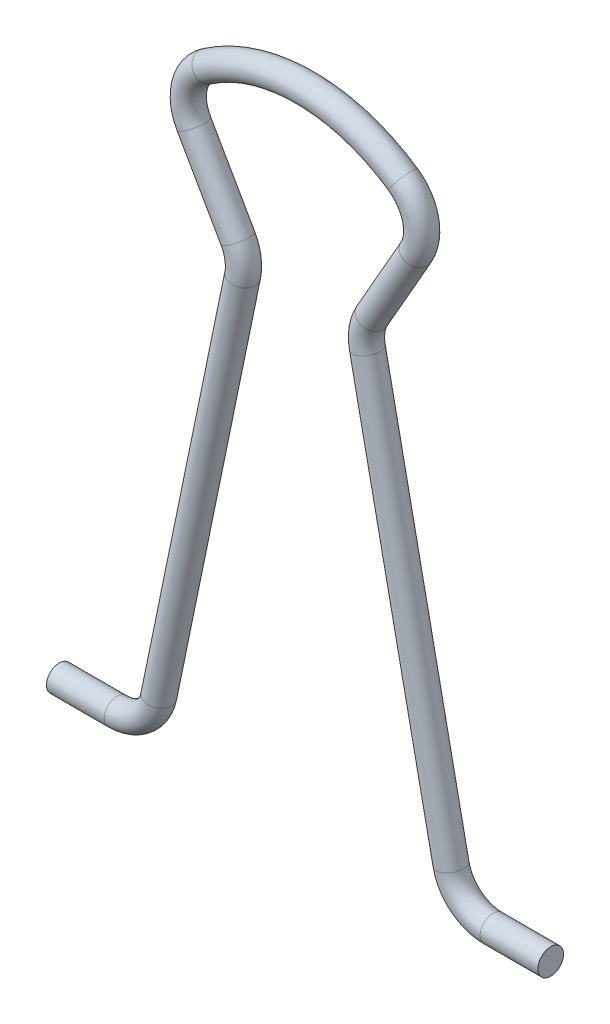
ISO-10303-21;
HEADER;
FILE_DESCRIPTION(('STEP AP214'),'2;1');
FILE_NAME('part.step','',(''),(''),'','','');
FILE_SCHEMA(('AUTOMOTIVE_DESIGN { 1 0 10303 214 1 1 1 1 }'));
ENDSEC;
DATA;
#1=APPLICATION_CONTEXT('core data for automotive mechanical design processes');
#2=APPLICATION_PROTOCOL_DEFINITION('international standard','automotive_design',2000,#1);
#3=PRODUCT_CONTEXT('',#1,'mechanical');
#4=PRODUCT('Part','Part','',(#3));
#5=PRODUCT_RELATED_PRODUCT_CATEGORY('part','',(#4));
#6=PRODUCT_DEFINITION_FORMATION('','',#4);
#7=PRODUCT_DEFINITION_CONTEXT('part definition',#1,'design');
#8=PRODUCT_DEFINITION('design','',#6,#7);
#9=PRODUCT_DEFINITION_SHAPE('','',#8);
#10=(LENGTH_UNIT() NAMED_UNIT(*) SI_UNIT(.MILLI.,.METRE.));
#11=(NAMED_UNIT(*) PLANE_ANGLE_UNIT() SI_UNIT($,.RADIAN.));
#12=(NAMED_UNIT(*) SI_UNIT($,.STERADIAN.) SOLID_ANGLE_UNIT());
#13=UNCERTAINTY_MEASURE_WITH_UNIT(LENGTH_MEASURE(1.E-05),#10,'distance_accuracy_value','');
#14=(GEOMETRIC_REPRESENTATION_CONTEXT(3) GLOBAL_UNCERTAINTY_ASSIGNED_CONTEXT((#13)) GLOBAL_UNIT_ASSIGNED_CONTEXT((#10,
#11,#12)) REPRESENTATION_CONTEXT('',''));
#15=CARTESIAN_POINT('',(0.,0.,0.));
#16=DIRECTION('',(0.,0.,1.));
#17=DIRECTION('',(1.,0.,0.));
#18=AXIS2_PLACEMENT_3D('',#15,#16,#17);
#19=CARTESIAN_POINT('',(-17.25,0.,0.));
#20=DIRECTION('',(-1.,0.,0.));
#21=DIRECTION('',(0.,-1.,0.));
#22=AXIS2_PLACEMENT_3D('',#19,#20,#21);
#23=PLANE('',#22);
#24=CARTESIAN_POINT('',(-17.25,0.,0.));
#25=DIRECTION('',(-1.,0.,0.));
#26=DIRECTION('',(0.,-1.,0.));
#27=AXIS2_PLACEMENT_3D('',#24,#25,#26);
#28=CIRCLE('',#27,0.9);
#29=CARTESIAN_POINT('',(-17.25,-0.9,0.));
#30=VERTEX_POINT('',#29);
#31=EDGE_CURVE('E88',#30,#30,#28,.T.);
#32=ORIENTED_EDGE('',*,*,#31,.T.);
#33=EDGE_LOOP('',(#32));
#34=FACE_BOUND('',#33,.T.);
#35=ADVANCED_FACE('F63',(#34),#23,.T.);
#36=CARTESIAN_POINT('',(-17.25,0.,0.));
#37=DIRECTION('',(1.,0.,0.));
#38=DIRECTION('',(0.,0.,-1.));
#39=AXIS2_PLACEMENT_3D('',#36,#37,#38);
#40=CYLINDRICAL_SURFACE('',#39,0.9);
#41=CARTESIAN_POINT('',(-13.1943940649274,0.,0.));
#42=DIRECTION('',(-1.,0.,0.));
#43=DIRECTION('',(0.,-1.,0.));
#44=AXIS2_PLACEMENT_3D('',#41,#42,#43);
#45=CIRCLE('',#44,0.9);
#46=CARTESIAN_POINT('',(-13.1943940649274,-0.9,0.));
#47=VERTEX_POINT('',#46);
#48=EDGE_CURVE('E85',#47,#47,#45,.T.);
#49=ORIENTED_EDGE('',*,*,#48,.T.);
#50=EDGE_LOOP('',(#49));
#51=FACE_BOUND('',#50,.T.);
#52=ORIENTED_EDGE('',*,*,#31,.F.);
#53=EDGE_LOOP('',(#52));
#54=FACE_BOUND('',#53,.T.);
#55=ADVANCED_FACE('F152',(#51,#54),#40,.T.);
#56=CARTESIAN_POINT('',(-13.1943940649274,3.,0.));
#57=DIRECTION('',(0.,0.,1.));
#58=DIRECTION('',(1.,0.,0.));
#59=AXIS2_PLACEMENT_3D('',#56,#57,#58);
#60=TOROIDAL_SURFACE('',#59,3.,0.9);
#61=CARTESIAN_POINT('',(-10.2562364695832,2.39400499596026,0.));
#62=DIRECTION('',(-0.201998334679915,-0.979385865114737,0.));
#63=DIRECTION('',(0.979385865114736,-0.201998334679915,0.));
#64=AXIS2_PLACEMENT_3D('',#61,#62,#63);
#65=CIRCLE('',#64,0.9);
#66=CARTESIAN_POINT('',(-9.37478919097993,2.21220649474833,0.));
#67=VERTEX_POINT('',#66);
#68=EDGE_CURVE('E82',#67,#67,#65,.T.);
#69=CARTESIAN_POINT('',(-13.1943940649274,3.,0.));
#70=DIRECTION('',(0.,0.,1.));
#71=DIRECTION('',(1.,0.,0.));
#72=AXIS2_PLACEMENT_3D('',#69,#70,#71);
#73=CIRCLE('',#72,3.9);
#74=EDGE_CURVE('',#47,#67,#73,.T.);
#75=ORIENTED_EDGE('',*,*,#48,.F.);
#76=ORIENTED_EDGE('',*,*,#68,.T.);
#77=ORIENTED_EDGE('',*,*,#74,.T.);
#78=ORIENTED_EDGE('',*,*,#74,.F.);
#79=EDGE_LOOP('',(#75,#77,#76,#78));
#80=FACE_BOUND('',#79,.T.);
#81=ADVANCED_FACE('F148',(#80),#60,.T.);
#82=CARTESIAN_POINT('',(-10.2562364695832,2.39400499596026,0.));
#83=DIRECTION('',(0.201998334679914,0.979385865114737,0.));
#84=DIRECTION('',(-0.979385865114737,0.201998334679914,0.));
#85=AXIS2_PLACEMENT_3D('',#82,#83,#84);
#86=CYLINDRICAL_SURFACE('',#85,0.9);
#87=CARTESIAN_POINT('',(-4.37875930411115,30.8908639800672,0.));
#88=DIRECTION('',(-0.201998334679915,-0.979385865114737,0.));
#89=DIRECTION('',(0.979385865114736,-0.201998334679915,0.));
#90=AXIS2_PLACEMENT_3D('',#87,#88,#89);
#91=CIRCLE('',#90,0.9);
#92=CARTESIAN_POINT('',(-3.49731202550788,30.7090654788552,0.));
#93=VERTEX_POINT('',#92);
#94=EDGE_CURVE('E77',#93,#93,#91,.T.);
#95=ORIENTED_EDGE('',*,*,#94,.T.);
#96=EDGE_LOOP('',(#95));
#97=FACE_BOUND('',#96,.T.);
#98=ORIENTED_EDGE('',*,*,#68,.F.);
#99=EDGE_LOOP('',(#98));
#100=FACE_BOUND('',#99,.T.);
#101=ADVANCED_FACE('F144',(#97,#100),#86,.T.);
#102=CARTESIAN_POINT('',(-7.31691689945536,31.4968589841069,0.));
#103=DIRECTION('',(0.,0.,1.));
#104=DIRECTION('',(1.,0.,0.));
#105=AXIS2_PLACEMENT_3D('',#102,#103,#104);
#106=TOROIDAL_SURFACE('',#105,3.,0.9);
#107=CARTESIAN_POINT('',(-4.71124476637078,32.9836248482787,0.));
#108=DIRECTION('',(0.495588621390594,-0.86855737769486,0.));
#109=DIRECTION('',(0.868557377694859,0.495588621390594,0.));
#110=AXIS2_PLACEMENT_3D('',#107,#108,#109);
#111=CIRCLE('',#110,0.9);
#112=CARTESIAN_POINT('',(-3.92954312644541,33.4296546075302,0.));
#113=VERTEX_POINT('',#112);
#114=EDGE_CURVE('E73',#113,#113,#111,.T.);
#115=CARTESIAN_POINT('',(-7.31691689945536,31.4968589841069,0.));
#116=DIRECTION('',(0.,0.,1.));
#117=DIRECTION('',(1.,0.,0.));
#118=AXIS2_PLACEMENT_3D('',#115,#116,#117);
#119=CIRCLE('',#118,3.9);
#120=EDGE_CURVE('',#93,#113,#119,.T.);
#121=ORIENTED_EDGE('',*,*,#94,.F.);
#122=ORIENTED_EDGE('',*,*,#114,.T.);
#123=ORIENTED_EDGE('',*,*,#120,.T.);
#124=ORIENTED_EDGE('',*,*,#120,.F.);
#125=EDGE_LOOP('',(#121,#123,#122,#124));
#126=FACE_BOUND('',#125,.T.);
#127=ADVANCED_FACE('F141',(#126),#106,.T.);
#128=CARTESIAN_POINT('',(-4.71124476637078,32.9836248482787,0.));
#129=DIRECTION('',(-0.495588621390595,0.868557377694859,0.));
#130=DIRECTION('',(-0.868557377694859,-0.495588621390595,0.));
#131=AXIS2_PLACEMENT_3D('',#128,#129,#130);
#132=CYLINDRICAL_SURFACE('',#131,0.9);
#133=CARTESIAN_POINT('',(-7.79739520578127,38.3923421132249,0.));
#134=DIRECTION('',(0.495588621390594,-0.868557377694859,0.));
#135=DIRECTION('',(0.868557377694859,0.495588621390594,0.));
#136=AXIS2_PLACEMENT_3D('',#133,#134,#135);
#137=CIRCLE('',#136,0.9);
#138=CARTESIAN_POINT('',(-8.57909684570664,37.9463123539734,0.));
#139=VERTEX_POINT('',#138);
#140=EDGE_CURVE('E69',#139,#139,#137,.T.);
#141=ORIENTED_EDGE('',*,*,#140,.T.);
#142=EDGE_LOOP('',(#141));
#143=FACE_BOUND('',#142,.T.);
#144=ORIENTED_EDGE('',*,*,#114,.F.);
#145=EDGE_LOOP('',(#144));
#146=FACE_BOUND('',#145,.T.);
#147=ADVANCED_FACE('F135',(#143,#146),#132,.T.);
#148=CARTESIAN_POINT('',(-5.1917230726967,39.8791079773967,0.));
#149=DIRECTION('',(0.,0.,-1.));
#150=DIRECTION('',(-1.,0.,0.));
#151=AXIS2_PLACEMENT_3D('',#148,#149,#150);
#152=TOROIDAL_SURFACE('',#151,2.99999999999999,0.9);
#153=CARTESIAN_POINT('',(-6.89859093221342,42.3462119699655,0.));
#154=DIRECTION('',(-0.822367997522927,-0.568955953172239,0.));
#155=DIRECTION('',(0.568955953172239,-0.822367997522927,0.));
#156=AXIS2_PLACEMENT_3D('',#153,#154,#155);
#157=CIRCLE('',#156,0.9);
#158=CARTESIAN_POINT('',(-7.41065129006844,43.0863431677361,0.));
#159=VERTEX_POINT('',#158);
#160=EDGE_CURVE('E11',#159,#159,#157,.T.);
#161=CARTESIAN_POINT('',(-5.1917230726967,39.8791079773967,0.));
#162=DIRECTION('',(0.,0.,-1.));
#163=DIRECTION('',(-1.,0.,0.));
#164=AXIS2_PLACEMENT_3D('',#161,#162,#163);
#165=CIRCLE('',#164,3.89999999999999);
#166=EDGE_CURVE('',#139,#159,#165,.T.);
#167=ORIENTED_EDGE('',*,*,#140,.F.);
#168=ORIENTED_EDGE('',*,*,#160,.T.);
#169=ORIENTED_EDGE('',*,*,#166,.T.);
#170=ORIENTED_EDGE('',*,*,#166,.F.);
#171=EDGE_LOOP('',(#167,#169,#168,#170));
#172=FACE_BOUND('',#171,.T.);
#173=ADVANCED_FACE('F130',(#172),#152,.T.);
#174=CARTESIAN_POINT('',(0.,32.375,0.));
#175=DIRECTION('',(0.,0.,-1.));
#176=DIRECTION('',(-1.,0.,0.));
#177=AXIS2_PLACEMENT_3D('',#174,#175,#176);
#178=TOROIDAL_SURFACE('',#177,12.125,0.9);
#179=CARTESIAN_POINT('',(6.89859093221342,42.3462119699655,0.));
#180=DIRECTION('',(-0.822367997522927,0.568955953172239,0.));
#181=DIRECTION('',(-0.568955953172239,-0.822367997522927,0.));
#182=AXIS2_PLACEMENT_3D('',#179,#180,#181);
#183=CIRCLE('',#182,0.9);
#184=CARTESIAN_POINT('',(7.41065129006844,43.0863431677361,0.));
#185=VERTEX_POINT('',#184);
#186=EDGE_CURVE('E91',#185,#185,#183,.F.);
#187=CARTESIAN_POINT('',(0.,32.375,0.));
#188=DIRECTION('',(0.,0.,-1.));
#189=DIRECTION('',(-1.,0.,0.));
#190=AXIS2_PLACEMENT_3D('',#187,#188,#189);
#191=CIRCLE('',#190,13.025);
#192=EDGE_CURVE('',#159,#185,#191,.T.);
#193=ORIENTED_EDGE('',*,*,#160,.F.);
#194=ORIENTED_EDGE('',*,*,#186,.F.);
#195=ORIENTED_EDGE('',*,*,#192,.T.);
#196=ORIENTED_EDGE('',*,*,#192,.F.);
#197=EDGE_LOOP('',(#193,#195,#194,#196));
#198=FACE_BOUND('',#197,.T.);
#199=ADVANCED_FACE('F127',(#198),#178,.T.);
#200=CARTESIAN_POINT('',(17.25,0.,0.));
#201=DIRECTION('',(1.,0.,0.));
#202=DIRECTION('',(0.,-1.,0.));
#203=AXIS2_PLACEMENT_3D('',#200,#201,#202);
#204=PLANE('',#203);
#205=CARTESIAN_POINT('',(17.25,0.,0.));
#206=DIRECTION('',(-1.,0.,0.));
#207=DIRECTION('',(0.,-1.,0.));
#208=AXIS2_PLACEMENT_3D('',#205,#206,#207);
#209=CIRCLE('',#208,0.9);
#210=CARTESIAN_POINT('',(17.25,-0.9,0.));
#211=VERTEX_POINT('',#210);
#212=EDGE_CURVE('E109',#211,#211,#209,.F.);
#213=ORIENTED_EDGE('',*,*,#212,.T.);
#214=EDGE_LOOP('',(#213));
#215=FACE_BOUND('',#214,.T.);
#216=ADVANCED_FACE('F113',(#215),#204,.T.);
#217=CARTESIAN_POINT('',(17.25,0.,0.));
#218=DIRECTION('',(-1.,0.,0.));
#219=DIRECTION('',(0.,0.,1.));
#220=AXIS2_PLACEMENT_3D('',#217,#218,#219);
#221=CYLINDRICAL_SURFACE('',#220,0.9);
#222=CARTESIAN_POINT('',(13.1943940649274,0.,0.));
#223=DIRECTION('',(-1.,0.,0.));
#224=DIRECTION('',(0.,-1.,0.));
#225=AXIS2_PLACEMENT_3D('',#222,#223,#224);
#226=CIRCLE('',#225,0.9);
#227=CARTESIAN_POINT('',(13.1943940649274,-0.9,0.));
#228=VERTEX_POINT('',#227);
#229=EDGE_CURVE('E106',#228,#228,#226,.F.);
#230=ORIENTED_EDGE('',*,*,#229,.T.);
#231=EDGE_LOOP('',(#230));
#232=FACE_BOUND('',#231,.T.);
#233=ORIENTED_EDGE('',*,*,#212,.F.);
#234=EDGE_LOOP('',(#233));
#235=FACE_BOUND('',#234,.T.);
#236=ADVANCED_FACE('F115',(#232,#235),#221,.T.);
#237=CARTESIAN_POINT('',(13.1943940649274,3.,0.));
#238=DIRECTION('',(0.,0.,-1.));
#239=DIRECTION('',(-1.,0.,0.));
#240=AXIS2_PLACEMENT_3D('',#237,#238,#239);
#241=TOROIDAL_SURFACE('',#240,3.,0.9);
#242=CARTESIAN_POINT('',(10.2562364695832,2.39400499596026,0.));
#243=DIRECTION('',(-0.201998334679915,0.979385865114737,0.));
#244=DIRECTION('',(-0.979385865114736,-0.201998334679915,0.));
#245=AXIS2_PLACEMENT_3D('',#242,#243,#244);
#246=CIRCLE('',#245,0.9);
#247=CARTESIAN_POINT('',(9.37478919097993,2.21220649474833,0.));
#248=VERTEX_POINT('',#247);
#249=EDGE_CURVE('E103',#248,#248,#246,.F.);
#250=CARTESIAN_POINT('',(13.1943940649274,3.,0.));
#251=DIRECTION('',(0.,0.,-1.));
#252=DIRECTION('',(-1.,0.,0.));
#253=AXIS2_PLACEMENT_3D('',#250,#251,#252);
#254=CIRCLE('',#253,3.9);
#255=EDGE_CURVE('',#228,#248,#254,.T.);
#256=ORIENTED_EDGE('',*,*,#229,.F.);
#257=ORIENTED_EDGE('',*,*,#249,.T.);
#258=ORIENTED_EDGE('',*,*,#255,.T.);
#259=ORIENTED_EDGE('',*,*,#255,.F.);
#260=EDGE_LOOP('',(#256,#258,#257,#259));
#261=FACE_BOUND('',#260,.T.);
#262=ADVANCED_FACE('F117',(#261),#241,.T.);
#263=CARTESIAN_POINT('',(10.2562364695832,2.39400499596026,0.));
#264=DIRECTION('',(-0.201998334679914,0.979385865114737,0.));
#265=DIRECTION('',(-0.979385865114737,-0.201998334679914,0.));
#266=AXIS2_PLACEMENT_3D('',#263,#264,#265);
#267=CYLINDRICAL_SURFACE('',#266,0.9);
#268=CARTESIAN_POINT('',(4.37875930411115,30.8908639800672,0.));
#269=DIRECTION('',(-0.201998334679915,0.979385865114737,0.));
#270=DIRECTION('',(-0.979385865114736,-0.201998334679915,0.));
#271=AXIS2_PLACEMENT_3D('',#268,#269,#270);
#272=CIRCLE('',#271,0.9);
#273=CARTESIAN_POINT('',(3.49731202550788,30.7090654788552,0.));
#274=VERTEX_POINT('',#273);
#275=EDGE_CURVE('E100',#274,#274,#272,.F.);
#276=ORIENTED_EDGE('',*,*,#275,.T.);
#277=EDGE_LOOP('',(#276));
#278=FACE_BOUND('',#277,.T.);
#279=ORIENTED_EDGE('',*,*,#249,.F.);
#280=EDGE_LOOP('',(#279));
#281=FACE_BOUND('',#280,.T.);
#282=ADVANCED_FACE('F124',(#278,#281),#267,.T.);
#283=CARTESIAN_POINT('',(7.31691689945536,31.4968589841069,0.));
#284=DIRECTION('',(0.,0.,-1.));
#285=DIRECTION('',(-1.,0.,0.));
#286=AXIS2_PLACEMENT_3D('',#283,#284,#285);
#287=TOROIDAL_SURFACE('',#286,3.,0.9);
#288=CARTESIAN_POINT('',(4.71124476637078,32.9836248482787,0.));
#289=DIRECTION('',(0.495588621390594,0.86855737769486,0.));
#290=DIRECTION('',(-0.868557377694859,0.495588621390594,0.));
#291=AXIS2_PLACEMENT_3D('',#288,#289,#290);
#292=CIRCLE('',#291,0.9);
#293=CARTESIAN_POINT('',(3.92954312644541,33.4296546075302,0.));
#294=VERTEX_POINT('',#293);
#295=EDGE_CURVE('E97',#294,#294,#292,.F.);
#296=CARTESIAN_POINT('',(7.31691689945536,31.4968589841069,0.));
#297=DIRECTION('',(0.,0.,-1.));
#298=DIRECTION('',(-1.,0.,0.));
#299=AXIS2_PLACEMENT_3D('',#296,#297,#298);
#300=CIRCLE('',#299,3.9);
#301=EDGE_CURVE('',#274,#294,#300,.T.);
#302=ORIENTED_EDGE('',*,*,#275,.F.);
#303=ORIENTED_EDGE('',*,*,#295,.T.);
#304=ORIENTED_EDGE('',*,*,#301,.T.);
#305=ORIENTED_EDGE('',*,*,#301,.F.);
#306=EDGE_LOOP('',(#302,#304,#303,#305));
#307=FACE_BOUND('',#306,.T.);
#308=ADVANCED_FACE('F164',(#307),#287,.T.);
#309=CARTESIAN_POINT('',(4.71124476637078,32.9836248482787,0.));
#310=DIRECTION('',(0.495588621390595,0.868557377694859,0.));
#311=DIRECTION('',(-0.868557377694859,0.495588621390595,0.));
#312=AXIS2_PLACEMENT_3D('',#309,#310,#311);
#313=CYLINDRICAL_SURFACE('',#312,0.9);
#314=CARTESIAN_POINT('',(7.79739520578127,38.3923421132249,0.));
#315=DIRECTION('',(0.495588621390594,0.868557377694859,0.));
#316=DIRECTION('',(-0.868557377694859,0.495588621390594,0.));
#317=AXIS2_PLACEMENT_3D('',#314,#315,#316);
#318=CIRCLE('',#317,0.9);
#319=CARTESIAN_POINT('',(8.57909684570664,37.9463123539734,0.));
#320=VERTEX_POINT('',#319);
#321=EDGE_CURVE('E94',#320,#320,#318,.F.);
#322=ORIENTED_EDGE('',*,*,#321,.T.);
#323=EDGE_LOOP('',(#322));
#324=FACE_BOUND('',#323,.T.);
#325=ORIENTED_EDGE('',*,*,#295,.F.);
#326=EDGE_LOOP('',(#325));
#327=FACE_BOUND('',#326,.T.);
#328=ADVANCED_FACE('F160',(#324,#327),#313,.T.);
#329=CARTESIAN_POINT('',(5.1917230726967,39.8791079773967,0.));
#330=DIRECTION('',(0.,0.,1.));
#331=DIRECTION('',(1.,0.,0.));
#332=AXIS2_PLACEMENT_3D('',#329,#330,#331);
#333=TOROIDAL_SURFACE('',#332,2.99999999999999,0.9);
#334=CARTESIAN_POINT('',(5.1917230726967,39.8791079773967,0.));
#335=DIRECTION('',(0.,0.,1.));
#336=DIRECTION('',(1.,0.,0.));
#337=AXIS2_PLACEMENT_3D('',#334,#335,#336);
#338=CIRCLE('',#337,3.89999999999999);
#339=EDGE_CURVE('',#320,#185,#338,.T.);
#340=ORIENTED_EDGE('',*,*,#321,.F.);
#341=ORIENTED_EDGE('',*,*,#186,.T.);
#342=ORIENTED_EDGE('',*,*,#339,.T.);
#343=ORIENTED_EDGE('',*,*,#339,.F.);
#344=EDGE_LOOP('',(#340,#342,#341,#343));
#345=FACE_BOUND('',#344,.T.);
#346=ADVANCED_FACE('F157',(#345),#333,.T.);
#347=CLOSED_SHELL('',(#35,#55,#81,#101,#127,#147,#173,#199,#216,#236,#262,#282,#308,#328,#346));
#348=MANIFOLD_SOLID_BREP('B2',#347);
#349=ADVANCED_BREP_SHAPE_REPRESENTATION('',(#18,#348),#14);
#350=SHAPE_DEFINITION_REPRESENTATION(#9,#349);
ENDSEC;
END-ISO-10303-21;
